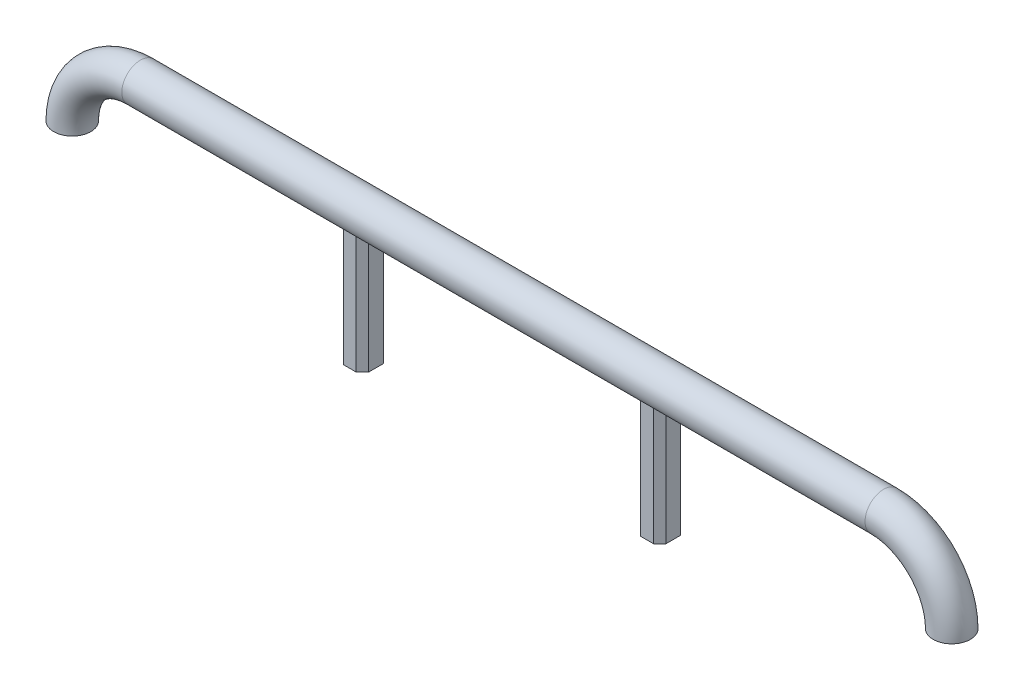
ISO-10303-21;
HEADER;
FILE_DESCRIPTION(('STEP AP214'),'2;1');
FILE_NAME('part.step','',(''),(''),'','','');
FILE_SCHEMA(('AUTOMOTIVE_DESIGN { 1 0 10303 214 1 1 1 1 }'));
ENDSEC;
DATA;
#1=APPLICATION_CONTEXT('core data for automotive mechanical design processes');
#2=APPLICATION_PROTOCOL_DEFINITION('international standard','automotive_design',2000,#1);
#3=PRODUCT_CONTEXT('',#1,'mechanical');
#4=PRODUCT('Part','Part','',(#3));
#5=PRODUCT_RELATED_PRODUCT_CATEGORY('part','',(#4));
#6=PRODUCT_DEFINITION_FORMATION('','',#4);
#7=PRODUCT_DEFINITION_CONTEXT('part definition',#1,'design');
#8=PRODUCT_DEFINITION('design','',#6,#7);
#9=PRODUCT_DEFINITION_SHAPE('','',#8);
#10=(LENGTH_UNIT() NAMED_UNIT(*) SI_UNIT(.MILLI.,.METRE.));
#11=(NAMED_UNIT(*) PLANE_ANGLE_UNIT() SI_UNIT($,.RADIAN.));
#12=(NAMED_UNIT(*) SI_UNIT($,.STERADIAN.) SOLID_ANGLE_UNIT());
#13=UNCERTAINTY_MEASURE_WITH_UNIT(LENGTH_MEASURE(1.E-05),#10,'distance_accuracy_value','');
#14=(GEOMETRIC_REPRESENTATION_CONTEXT(3) GLOBAL_UNCERTAINTY_ASSIGNED_CONTEXT((#13)) GLOBAL_UNIT_ASSIGNED_CONTEXT((#10,
#11,#12)) REPRESENTATION_CONTEXT('',''));
#15=CARTESIAN_POINT('',(0.,0.,0.));
#16=DIRECTION('',(0.,0.,1.));
#17=DIRECTION('',(1.,0.,0.));
#18=AXIS2_PLACEMENT_3D('',#15,#16,#17);
#19=CARTESIAN_POINT('',(381.,6.35,0.));
#20=DIRECTION('',(-1.,0.,0.));
#21=DIRECTION('',(0.,0.,1.));
#22=AXIS2_PLACEMENT_3D('',#19,#20,#21);
#23=CYLINDRICAL_SURFACE('',#22,19.05);
#24=CARTESIAN_POINT('',(139.409321276214,6.35,0.));
#25=DIRECTION('',(-1.,0.,0.));
#26=DIRECTION('',(0.,0.,1.));
#27=AXIS2_PLACEMENT_3D('',#24,#25,#26);
#28=CIRCLE('',#27,19.05);
#29=CARTESIAN_POINT('',(139.409321276214,-11.1254614235985,-7.58358411520046));
#30=VERTEX_POINT('',#29);
#31=CARTESIAN_POINT('',(139.409321276214,-11.1254614235984,7.58358411520061));
#32=VERTEX_POINT('',#31);
#33=EDGE_CURVE('E224',#30,#32,#28,.T.);
#34=ORIENTED_EDGE('',*,*,#33,.T.);
#35=CARTESIAN_POINT('',(131.825737161013,6.35,0.));
#36=DIRECTION('',(0.707106781186548,0.,-0.707106781186547));
#37=DIRECTION('',(-0.707106781186547,0.,-0.707106781186548));
#38=AXIS2_PLACEMENT_3D('',#35,#36,#37);
#39=ELLIPSE('',#38,26.9407683632075,19.05);
#40=CARTESIAN_POINT('',(145.759321276214,-6.64067872378632,13.9335841152004));
#41=VERTEX_POINT('',#40);
#42=EDGE_CURVE('E314',#32,#41,#39,.F.);
#43=ORIENTED_EDGE('',*,*,#42,.T.);
#44=DIRECTION('',(-1.,0.,0.));
#45=VECTOR('',#44,1.);
#46=CARTESIAN_POINT('',(381.,-6.64067872378632,13.9335841152004));
#47=LINE('',#46,#45);
#48=CARTESIAN_POINT('',(159.040678723786,-6.64067872378632,13.9335841152004));
#49=VERTEX_POINT('',#48);
#50=EDGE_CURVE('E228',#41,#49,#47,.F.);
#51=ORIENTED_EDGE('',*,*,#50,.T.);
#52=CARTESIAN_POINT('',(172.974262838987,6.35,0.));
#53=DIRECTION('',(-0.707106781186554,0.,-0.707106781186541));
#54=DIRECTION('',(-0.707106781186541,0.,0.707106781186554));
#55=AXIS2_PLACEMENT_3D('',#52,#53,#54);
#56=ELLIPSE('',#55,26.9407683632072,19.05);
#57=CARTESIAN_POINT('',(165.390678723786,-11.1254614235985,7.58358411520039));
#58=VERTEX_POINT('',#57);
#59=EDGE_CURVE('E317',#49,#58,#56,.F.);
#60=ORIENTED_EDGE('',*,*,#59,.T.);
#61=CARTESIAN_POINT('',(165.390678723786,6.35,0.));
#62=DIRECTION('',(1.,0.,0.));
#63=DIRECTION('',(0.,0.,-1.));
#64=AXIS2_PLACEMENT_3D('',#61,#62,#63);
#65=CIRCLE('',#64,19.05);
#66=CARTESIAN_POINT('',(165.390678723786,-11.1254614235985,-7.58358411520057));
#67=VERTEX_POINT('',#66);
#68=EDGE_CURVE('E232',#58,#67,#65,.T.);
#69=ORIENTED_EDGE('',*,*,#68,.T.);
#70=CARTESIAN_POINT('',(172.974262838987,6.35,0.));
#71=DIRECTION('',(-0.707106781186548,0.,0.707106781186548));
#72=DIRECTION('',(-0.707106781186547,0.,-0.707106781186548));
#73=AXIS2_PLACEMENT_3D('',#70,#71,#72);
#74=ELLIPSE('',#73,26.9407683632075,19.05);
#75=CARTESIAN_POINT('',(159.040678723786,-6.64067872378615,-13.9335841152006));
#76=VERTEX_POINT('',#75);
#77=EDGE_CURVE('E54',#67,#76,#74,.F.);
#78=ORIENTED_EDGE('',*,*,#77,.T.);
#79=DIRECTION('',(-1.,0.,0.));
#80=VECTOR('',#79,1.);
#81=CARTESIAN_POINT('',(381.,-6.64067872378615,-13.9335841152006));
#82=LINE('',#81,#80);
#83=CARTESIAN_POINT('',(145.759321276214,-6.64067872378615,-13.9335841152006));
#84=VERTEX_POINT('',#83);
#85=EDGE_CURVE('E221',#76,#84,#82,.T.);
#86=ORIENTED_EDGE('',*,*,#85,.T.);
#87=CARTESIAN_POINT('',(131.825737161013,6.35,0.));
#88=DIRECTION('',(0.707106781186547,0.,0.707106781186548));
#89=DIRECTION('',(-0.707106781186548,0.,0.707106781186547));
#90=AXIS2_PLACEMENT_3D('',#87,#88,#89);
#91=ELLIPSE('',#90,26.9407683632075,19.05);
#92=EDGE_CURVE('E11',#84,#30,#91,.F.);
#93=ORIENTED_EDGE('',*,*,#92,.T.);
#94=EDGE_LOOP('',(#34,#43,#51,#60,#69,#78,#86,#93));
#95=FACE_BOUND('',#94,.T.);
#96=DIRECTION('',(-1.,0.,0.));
#97=VECTOR('',#96,1.);
#98=CARTESIAN_POINT('',(381.,-6.64067872378616,-13.9335841152006));
#99=LINE('',#98,#97);
#100=CARTESIAN_POINT('',(-159.040678723786,-6.64067872378616,-13.9335841152006));
#101=VERTEX_POINT('',#100);
#102=CARTESIAN_POINT('',(-145.759321276214,-6.64067872378616,-13.9335841152006));
#103=VERTEX_POINT('',#102);
#104=EDGE_CURVE('E193',#101,#103,#99,.F.);
#105=ORIENTED_EDGE('',*,*,#104,.F.);
#106=CARTESIAN_POINT('',(-172.974262838986,6.35,0.));
#107=DIRECTION('',(0.707106781186554,0.,0.707106781186541));
#108=DIRECTION('',(-0.707106781186541,0.,0.707106781186554));
#109=AXIS2_PLACEMENT_3D('',#106,#107,#108);
#110=ELLIPSE('',#109,26.9407683632072,19.05);
#111=CARTESIAN_POINT('',(-165.390678723786,-11.1254614235985,-7.58358411520045));
#112=VERTEX_POINT('',#111);
#113=EDGE_CURVE('E308',#101,#112,#110,.F.);
#114=ORIENTED_EDGE('',*,*,#113,.T.);
#115=CARTESIAN_POINT('',(-165.390678723786,6.35,0.));
#116=DIRECTION('',(-1.,0.,0.));
#117=DIRECTION('',(0.,0.,1.));
#118=AXIS2_PLACEMENT_3D('',#115,#116,#117);
#119=CIRCLE('',#118,19.05);
#120=CARTESIAN_POINT('',(-165.390678723786,-11.1254614235985,7.58358411520053));
#121=VERTEX_POINT('',#120);
#122=EDGE_CURVE('E217',#121,#112,#119,.F.);
#123=ORIENTED_EDGE('',*,*,#122,.F.);
#124=CARTESIAN_POINT('',(-172.974262838987,6.35,0.));
#125=DIRECTION('',(0.707106781186548,0.,-0.707106781186548));
#126=DIRECTION('',(-0.707106781186548,0.,-0.707106781186548));
#127=AXIS2_PLACEMENT_3D('',#124,#125,#126);
#128=ELLIPSE('',#127,26.9407683632075,19.05);
#129=CARTESIAN_POINT('',(-159.040678723786,-6.64067872378628,13.9335841152005));
#130=VERTEX_POINT('',#129);
#131=EDGE_CURVE('E169',#121,#130,#128,.F.);
#132=ORIENTED_EDGE('',*,*,#131,.T.);
#133=DIRECTION('',(-1.,0.,0.));
#134=VECTOR('',#133,1.);
#135=CARTESIAN_POINT('',(381.,-6.64067872378628,13.9335841152005));
#136=LINE('',#135,#134);
#137=CARTESIAN_POINT('',(-145.759321276214,-6.64067872378628,13.9335841152005));
#138=VERTEX_POINT('',#137);
#139=EDGE_CURVE('E176',#138,#130,#136,.T.);
#140=ORIENTED_EDGE('',*,*,#139,.F.);
#141=CARTESIAN_POINT('',(-131.825737161013,6.35,0.));
#142=DIRECTION('',(-0.707106781186548,0.,-0.707106781186548));
#143=DIRECTION('',(-0.707106781186548,0.,0.707106781186548));
#144=AXIS2_PLACEMENT_3D('',#141,#142,#143);
#145=ELLIPSE('',#144,26.9407683632075,19.05);
#146=CARTESIAN_POINT('',(-139.409321276214,-11.1254614235985,7.58358411520042));
#147=VERTEX_POINT('',#146);
#148=EDGE_CURVE('E158',#138,#147,#145,.F.);
#149=ORIENTED_EDGE('',*,*,#148,.T.);
#150=CARTESIAN_POINT('',(-139.409321276214,6.35,0.));
#151=DIRECTION('',(1.,0.,0.));
#152=DIRECTION('',(0.,0.,-1.));
#153=AXIS2_PLACEMENT_3D('',#150,#151,#152);
#154=CIRCLE('',#153,19.05);
#155=CARTESIAN_POINT('',(-139.409321276214,-11.1254614235985,-7.58358411520045));
#156=VERTEX_POINT('',#155);
#157=EDGE_CURVE('E188',#156,#147,#154,.F.);
#158=ORIENTED_EDGE('',*,*,#157,.F.);
#159=CARTESIAN_POINT('',(-131.825737161013,6.35,0.));
#160=DIRECTION('',(-0.707106781186548,0.,0.707106781186548));
#161=DIRECTION('',(-0.707106781186548,0.,-0.707106781186548));
#162=AXIS2_PLACEMENT_3D('',#159,#160,#161);
#163=ELLIPSE('',#162,26.9407683632075,19.05);
#164=EDGE_CURVE('E311',#156,#103,#163,.F.);
#165=ORIENTED_EDGE('',*,*,#164,.T.);
#166=EDGE_LOOP('',(#105,#114,#123,#132,#140,#149,#158,#165));
#167=FACE_BOUND('',#166,.T.);
#168=CARTESIAN_POINT('',(381.,6.35,0.));
#169=DIRECTION('',(1.,0.,0.));
#170=DIRECTION('',(0.,0.,-1.));
#171=AXIS2_PLACEMENT_3D('',#168,#169,#170);
#172=CIRCLE('',#171,19.05);
#173=CARTESIAN_POINT('',(381.,25.4,0.));
#174=VERTEX_POINT('',#173);
#175=EDGE_CURVE('E189',#174,#174,#172,.T.);
#176=ORIENTED_EDGE('',*,*,#175,.F.);
#177=EDGE_LOOP('',(#176));
#178=FACE_BOUND('',#177,.T.);
#179=CARTESIAN_POINT('',(-381.,6.35,0.));
#180=DIRECTION('',(-1.,0.,0.));
#181=DIRECTION('',(0.,0.,1.));
#182=AXIS2_PLACEMENT_3D('',#179,#180,#181);
#183=CIRCLE('',#182,19.05);
#184=CARTESIAN_POINT('',(-381.,25.4,0.));
#185=VERTEX_POINT('',#184);
#186=EDGE_CURVE('E351',#185,#185,#183,.T.);
#187=ORIENTED_EDGE('',*,*,#186,.F.);
#188=EDGE_LOOP('',(#187));
#189=FACE_BOUND('',#188,.T.);
#190=ADVANCED_FACE('F44',(#95,#167,#178,#189),#23,.T.);
#191=CARTESIAN_POINT('',(-139.409321276214,-127.,-13.9335841152005));
#192=DIRECTION('',(0.,0.,-1.));
#193=DIRECTION('',(-1.,0.,0.));
#194=AXIS2_PLACEMENT_3D('',#191,#192,#193);
#195=PLANE('',#194);
#196=DIRECTION('',(-1.,0.,0.));
#197=VECTOR('',#196,1.);
#198=CARTESIAN_POINT('',(-139.409321276214,-127.,-13.9335841152005));
#199=LINE('',#198,#197);
#200=CARTESIAN_POINT('',(-145.759321276214,-127.,-13.9335841152005));
#201=VERTEX_POINT('',#200);
#202=CARTESIAN_POINT('',(-159.040678723786,-127.,-13.9335841152005));
#203=VERTEX_POINT('',#202);
#204=EDGE_CURVE('E203',#201,#203,#199,.T.);
#205=ORIENTED_EDGE('',*,*,#204,.T.);
#206=DIRECTION('',(0.,1.,0.));
#207=VECTOR('',#206,1.);
#208=CARTESIAN_POINT('',(-159.040678723786,-127.,-13.9335841152005));
#209=LINE('',#208,#207);
#210=EDGE_CURVE('E264',#203,#101,#209,.T.);
#211=ORIENTED_EDGE('',*,*,#210,.T.);
#212=ORIENTED_EDGE('',*,*,#104,.T.);
#213=DIRECTION('',(0.,-1.,0.));
#214=VECTOR('',#213,1.);
#215=CARTESIAN_POINT('',(-145.759321276214,-127.,-13.9335841152005));
#216=LINE('',#215,#214);
#217=EDGE_CURVE('E261',#103,#201,#216,.T.);
#218=ORIENTED_EDGE('',*,*,#217,.T.);
#219=EDGE_LOOP('',(#205,#211,#212,#218));
#220=FACE_BOUND('',#219,.T.);
#221=ADVANCED_FACE('F386',(#220),#195,.T.);
#222=CARTESIAN_POINT('',(-139.409321276214,-127.,13.9335841152005));
#223=DIRECTION('',(0.,0.,1.));
#224=DIRECTION('',(1.,0.,0.));
#225=AXIS2_PLACEMENT_3D('',#222,#223,#224);
#226=PLANE('',#225);
#227=DIRECTION('',(1.,0.,0.));
#228=VECTOR('',#227,1.);
#229=CARTESIAN_POINT('',(-139.409321276214,-127.,13.9335841152005));
#230=LINE('',#229,#228);
#231=CARTESIAN_POINT('',(-159.040678723786,-127.,13.9335841152005));
#232=VERTEX_POINT('',#231);
#233=CARTESIAN_POINT('',(-145.759321276214,-127.,13.9335841152005));
#234=VERTEX_POINT('',#233);
#235=EDGE_CURVE('E179',#232,#234,#230,.T.);
#236=ORIENTED_EDGE('',*,*,#235,.T.);
#237=DIRECTION('',(0.,1.,0.));
#238=VECTOR('',#237,1.);
#239=CARTESIAN_POINT('',(-145.759321276214,-127.,13.9335841152005));
#240=LINE('',#239,#238);
#241=EDGE_CURVE('E162',#234,#138,#240,.T.);
#242=ORIENTED_EDGE('',*,*,#241,.T.);
#243=ORIENTED_EDGE('',*,*,#139,.T.);
#244=DIRECTION('',(0.,-1.,0.));
#245=VECTOR('',#244,1.);
#246=CARTESIAN_POINT('',(-159.040678723786,-127.,13.9335841152005));
#247=LINE('',#246,#245);
#248=EDGE_CURVE('E182',#130,#232,#247,.T.);
#249=ORIENTED_EDGE('',*,*,#248,.T.);
#250=EDGE_LOOP('',(#236,#242,#243,#249));
#251=FACE_BOUND('',#250,.T.);
#252=ADVANCED_FACE('F175',(#251),#226,.T.);
#253=CARTESIAN_POINT('',(-139.409321276214,-127.,13.9335841152005));
#254=DIRECTION('',(1.,0.,0.));
#255=DIRECTION('',(0.,0.,-1.));
#256=AXIS2_PLACEMENT_3D('',#253,#254,#255);
#257=PLANE('',#256);
#258=ORIENTED_EDGE('',*,*,#157,.T.);
#259=DIRECTION('',(0.,-1.,0.));
#260=VECTOR('',#259,1.);
#261=CARTESIAN_POINT('',(-139.409321276214,-127.,7.58358411520042));
#262=LINE('',#261,#260);
#263=CARTESIAN_POINT('',(-139.409321276214,-127.,7.58358411520042));
#264=VERTEX_POINT('',#263);
#265=EDGE_CURVE('E163',#147,#264,#262,.T.);
#266=ORIENTED_EDGE('',*,*,#265,.T.);
#267=DIRECTION('',(0.,0.,-1.));
#268=VECTOR('',#267,1.);
#269=CARTESIAN_POINT('',(-139.409321276214,-127.,13.9335841152005));
#270=LINE('',#269,#268);
#271=CARTESIAN_POINT('',(-139.409321276214,-127.,-7.58358411520045));
#272=VERTEX_POINT('',#271);
#273=EDGE_CURVE('E213',#264,#272,#270,.T.);
#274=ORIENTED_EDGE('',*,*,#273,.T.);
#275=DIRECTION('',(0.,1.,0.));
#276=VECTOR('',#275,1.);
#277=CARTESIAN_POINT('',(-139.409321276214,-127.,-7.58358411520045));
#278=LINE('',#277,#276);
#279=EDGE_CURVE('E181',#272,#156,#278,.T.);
#280=ORIENTED_EDGE('',*,*,#279,.T.);
#281=EDGE_LOOP('',(#258,#266,#274,#280));
#282=FACE_BOUND('',#281,.T.);
#283=ADVANCED_FACE('F401',(#282),#257,.T.);
#284=CARTESIAN_POINT('',(-165.390678723786,-127.,-13.9335841152005));
#285=DIRECTION('',(-1.,0.,0.));
#286=DIRECTION('',(0.,0.,1.));
#287=AXIS2_PLACEMENT_3D('',#284,#285,#286);
#288=PLANE('',#287);
#289=DIRECTION('',(0.,0.,1.));
#290=VECTOR('',#289,1.);
#291=CARTESIAN_POINT('',(-165.390678723786,-127.,-13.9335841152005));
#292=LINE('',#291,#290);
#293=CARTESIAN_POINT('',(-165.390678723786,-127.,-7.58358411520045));
#294=VERTEX_POINT('',#293);
#295=CARTESIAN_POINT('',(-165.390678723786,-127.,7.58358411520053));
#296=VERTEX_POINT('',#295);
#297=EDGE_CURVE('E207',#294,#296,#292,.T.);
#298=ORIENTED_EDGE('',*,*,#297,.T.);
#299=DIRECTION('',(0.,1.,0.));
#300=VECTOR('',#299,1.);
#301=CARTESIAN_POINT('',(-165.390678723786,-127.,7.58358411520053));
#302=LINE('',#301,#300);
#303=EDGE_CURVE('E257',#296,#121,#302,.T.);
#304=ORIENTED_EDGE('',*,*,#303,.T.);
#305=ORIENTED_EDGE('',*,*,#122,.T.);
#306=DIRECTION('',(0.,-1.,0.));
#307=VECTOR('',#306,1.);
#308=CARTESIAN_POINT('',(-165.390678723786,-127.,-7.58358411520045));
#309=LINE('',#308,#307);
#310=EDGE_CURVE('E254',#112,#294,#309,.T.);
#311=ORIENTED_EDGE('',*,*,#310,.T.);
#312=EDGE_LOOP('',(#298,#304,#305,#311));
#313=FACE_BOUND('',#312,.T.);
#314=ADVANCED_FACE('F399',(#313),#288,.T.);
#315=CARTESIAN_POINT('',(0.,-127.,0.));
#316=DIRECTION('',(0.,1.,0.));
#317=DIRECTION('',(0.,0.,1.));
#318=AXIS2_PLACEMENT_3D('',#315,#316,#317);
#319=PLANE('',#318);
#320=ORIENTED_EDGE('',*,*,#273,.F.);
#321=DIRECTION('',(0.707106781186548,0.,-0.707106781186548));
#322=VECTOR('',#321,1.);
#323=CARTESIAN_POINT('',(-145.759321276214,-127.,13.9335841152005));
#324=LINE('',#323,#322);
#325=EDGE_CURVE('E251',#264,#234,#324,.F.);
#326=ORIENTED_EDGE('',*,*,#325,.T.);
#327=ORIENTED_EDGE('',*,*,#235,.F.);
#328=DIRECTION('',(0.707106781186548,0.,0.707106781186548));
#329=VECTOR('',#328,1.);
#330=CARTESIAN_POINT('',(-165.390678723786,-127.,7.58358411520053));
#331=LINE('',#330,#329);
#332=EDGE_CURVE('E248',#232,#296,#331,.F.);
#333=ORIENTED_EDGE('',*,*,#332,.T.);
#334=ORIENTED_EDGE('',*,*,#297,.F.);
#335=DIRECTION('',(-0.707106781186541,0.,0.707106781186554));
#336=VECTOR('',#335,1.);
#337=CARTESIAN_POINT('',(-159.040678723786,-127.,-13.9335841152005));
#338=LINE('',#337,#336);
#339=EDGE_CURVE('E245',#294,#203,#338,.F.);
#340=ORIENTED_EDGE('',*,*,#339,.T.);
#341=ORIENTED_EDGE('',*,*,#204,.F.);
#342=DIRECTION('',(-0.707106781186548,0.,-0.707106781186548));
#343=VECTOR('',#342,1.);
#344=CARTESIAN_POINT('',(-139.409321276214,-127.,-7.58358411520045));
#345=LINE('',#344,#343);
#346=EDGE_CURVE('E242',#201,#272,#345,.F.);
#347=ORIENTED_EDGE('',*,*,#346,.T.);
#348=EDGE_LOOP('',(#320,#326,#327,#333,#334,#340,#341,#347));
#349=FACE_BOUND('',#348,.T.);
#350=ADVANCED_FACE('F396',(#349),#319,.F.);
#351=CARTESIAN_POINT('',(165.390678723786,-127.,13.9335841152005));
#352=DIRECTION('',(0.,0.,1.));
#353=DIRECTION('',(1.,0.,0.));
#354=AXIS2_PLACEMENT_3D('',#351,#352,#353);
#355=PLANE('',#354);
#356=ORIENTED_EDGE('',*,*,#50,.F.);
#357=DIRECTION('',(0.,-1.,0.));
#358=VECTOR('',#357,1.);
#359=CARTESIAN_POINT('',(145.759321276214,-127.,13.9335841152005));
#360=LINE('',#359,#358);
#361=CARTESIAN_POINT('',(145.759321276214,-127.,13.9335841152005));
#362=VERTEX_POINT('',#361);
#363=EDGE_CURVE('E279',#41,#362,#360,.T.);
#364=ORIENTED_EDGE('',*,*,#363,.T.);
#365=DIRECTION('',(1.,0.,0.));
#366=VECTOR('',#365,1.);
#367=CARTESIAN_POINT('',(165.390678723786,-127.,13.9335841152005));
#368=LINE('',#367,#366);
#369=CARTESIAN_POINT('',(159.040678723786,-127.,13.9335841152005));
#370=VERTEX_POINT('',#369);
#371=EDGE_CURVE('E336',#362,#370,#368,.T.);
#372=ORIENTED_EDGE('',*,*,#371,.T.);
#373=DIRECTION('',(0.,1.,0.));
#374=VECTOR('',#373,1.);
#375=CARTESIAN_POINT('',(159.040678723786,-127.,13.9335841152005));
#376=LINE('',#375,#374);
#377=EDGE_CURVE('E275',#370,#49,#376,.T.);
#378=ORIENTED_EDGE('',*,*,#377,.T.);
#379=EDGE_LOOP('',(#356,#364,#372,#378));
#380=FACE_BOUND('',#379,.T.);
#381=ADVANCED_FACE('F339',(#380),#355,.T.);
#382=CARTESIAN_POINT('',(165.390678723786,-127.,-13.9335841152005));
#383=DIRECTION('',(0.,0.,-1.));
#384=DIRECTION('',(-1.,0.,0.));
#385=AXIS2_PLACEMENT_3D('',#382,#383,#384);
#386=PLANE('',#385);
#387=ORIENTED_EDGE('',*,*,#85,.F.);
#388=DIRECTION('',(0.,-1.,0.));
#389=VECTOR('',#388,1.);
#390=CARTESIAN_POINT('',(159.040678723786,-127.,-13.9335841152005));
#391=LINE('',#390,#389);
#392=CARTESIAN_POINT('',(159.040678723786,-127.,-13.9335841152005));
#393=VERTEX_POINT('',#392);
#394=EDGE_CURVE('E170',#76,#393,#391,.T.);
#395=ORIENTED_EDGE('',*,*,#394,.T.);
#396=DIRECTION('',(-1.,0.,0.));
#397=VECTOR('',#396,1.);
#398=CARTESIAN_POINT('',(165.390678723786,-127.,-13.9335841152005));
#399=LINE('',#398,#397);
#400=CARTESIAN_POINT('',(145.759321276214,-127.,-13.9335841152005));
#401=VERTEX_POINT('',#400);
#402=EDGE_CURVE('E348',#393,#401,#399,.T.);
#403=ORIENTED_EDGE('',*,*,#402,.T.);
#404=DIRECTION('',(0.,1.,0.));
#405=VECTOR('',#404,1.);
#406=CARTESIAN_POINT('',(145.759321276214,-127.,-13.9335841152005));
#407=LINE('',#406,#405);
#408=EDGE_CURVE('E301',#401,#84,#407,.T.);
#409=ORIENTED_EDGE('',*,*,#408,.T.);
#410=EDGE_LOOP('',(#387,#395,#403,#409));
#411=FACE_BOUND('',#410,.T.);
#412=ADVANCED_FACE('F364',(#411),#386,.T.);
#413=CARTESIAN_POINT('',(165.390678723786,-127.,13.9335841152005));
#414=DIRECTION('',(1.,0.,0.));
#415=DIRECTION('',(0.,0.,-1.));
#416=AXIS2_PLACEMENT_3D('',#413,#414,#415);
#417=PLANE('',#416);
#418=ORIENTED_EDGE('',*,*,#68,.F.);
#419=DIRECTION('',(0.,-1.,0.));
#420=VECTOR('',#419,1.);
#421=CARTESIAN_POINT('',(165.390678723786,-127.,7.58358411520039));
#422=LINE('',#421,#420);
#423=CARTESIAN_POINT('',(165.390678723786,-127.,7.58358411520039));
#424=VERTEX_POINT('',#423);
#425=EDGE_CURVE('E298',#58,#424,#422,.T.);
#426=ORIENTED_EDGE('',*,*,#425,.T.);
#427=DIRECTION('',(0.,0.,-1.));
#428=VECTOR('',#427,1.);
#429=CARTESIAN_POINT('',(165.390678723786,-127.,13.9335841152005));
#430=LINE('',#429,#428);
#431=CARTESIAN_POINT('',(165.390678723786,-127.,-7.58358411520057));
#432=VERTEX_POINT('',#431);
#433=EDGE_CURVE('E196',#424,#432,#430,.T.);
#434=ORIENTED_EDGE('',*,*,#433,.T.);
#435=DIRECTION('',(0.,1.,0.));
#436=VECTOR('',#435,1.);
#437=CARTESIAN_POINT('',(165.390678723786,-127.,-7.58358411520057));
#438=LINE('',#437,#436);
#439=EDGE_CURVE('E294',#432,#67,#438,.T.);
#440=ORIENTED_EDGE('',*,*,#439,.T.);
#441=EDGE_LOOP('',(#418,#426,#434,#440));
#442=FACE_BOUND('',#441,.T.);
#443=ADVANCED_FACE('F326',(#442),#417,.T.);
#444=CARTESIAN_POINT('',(139.409321276214,-127.,-13.9335841152005));
#445=DIRECTION('',(-1.,0.,0.));
#446=DIRECTION('',(0.,0.,1.));
#447=AXIS2_PLACEMENT_3D('',#444,#445,#446);
#448=PLANE('',#447);
#449=DIRECTION('',(0.,0.,1.));
#450=VECTOR('',#449,1.);
#451=CARTESIAN_POINT('',(139.409321276214,-127.,-13.9335841152005));
#452=LINE('',#451,#450);
#453=CARTESIAN_POINT('',(139.409321276214,-127.,-7.58358411520046));
#454=VERTEX_POINT('',#453);
#455=CARTESIAN_POINT('',(139.409321276214,-127.,7.58358411520061));
#456=VERTEX_POINT('',#455);
#457=EDGE_CURVE('E342',#454,#456,#452,.T.);
#458=ORIENTED_EDGE('',*,*,#457,.T.);
#459=DIRECTION('',(0.,1.,0.));
#460=VECTOR('',#459,1.);
#461=CARTESIAN_POINT('',(139.409321276214,-127.,7.58358411520061));
#462=LINE('',#461,#460);
#463=EDGE_CURVE('E271',#456,#32,#462,.T.);
#464=ORIENTED_EDGE('',*,*,#463,.T.);
#465=ORIENTED_EDGE('',*,*,#33,.F.);
#466=DIRECTION('',(0.,-1.,0.));
#467=VECTOR('',#466,1.);
#468=CARTESIAN_POINT('',(139.409321276214,-127.,-7.58358411520046));
#469=LINE('',#468,#467);
#470=EDGE_CURVE('E268',#30,#454,#469,.T.);
#471=ORIENTED_EDGE('',*,*,#470,.T.);
#472=EDGE_LOOP('',(#458,#464,#465,#471));
#473=FACE_BOUND('',#472,.T.);
#474=ADVANCED_FACE('F369',(#473),#448,.T.);
#475=CARTESIAN_POINT('',(0.,-127.,0.));
#476=DIRECTION('',(0.,1.,0.));
#477=DIRECTION('',(0.,0.,1.));
#478=AXIS2_PLACEMENT_3D('',#475,#476,#477);
#479=PLANE('',#478);
#480=ORIENTED_EDGE('',*,*,#371,.F.);
#481=DIRECTION('',(0.707106781186547,0.,0.707106781186548));
#482=VECTOR('',#481,1.);
#483=CARTESIAN_POINT('',(139.409321276214,-127.,7.5835841152006));
#484=LINE('',#483,#482);
#485=EDGE_CURVE('E291',#362,#456,#484,.F.);
#486=ORIENTED_EDGE('',*,*,#485,.T.);
#487=ORIENTED_EDGE('',*,*,#457,.F.);
#488=DIRECTION('',(-0.707106781186548,0.,0.707106781186547));
#489=VECTOR('',#488,1.);
#490=CARTESIAN_POINT('',(145.759321276214,-127.,-13.9335841152005));
#491=LINE('',#490,#489);
#492=EDGE_CURVE('E282',#454,#401,#491,.F.);
#493=ORIENTED_EDGE('',*,*,#492,.T.);
#494=ORIENTED_EDGE('',*,*,#402,.F.);
#495=DIRECTION('',(-0.707106781186547,0.,-0.707106781186548));
#496=VECTOR('',#495,1.);
#497=CARTESIAN_POINT('',(165.390678723786,-127.,-7.58358411520058));
#498=LINE('',#497,#496);
#499=EDGE_CURVE('E285',#393,#432,#498,.F.);
#500=ORIENTED_EDGE('',*,*,#499,.T.);
#501=ORIENTED_EDGE('',*,*,#433,.F.);
#502=DIRECTION('',(0.707106781186541,0.,-0.707106781186554));
#503=VECTOR('',#502,1.);
#504=CARTESIAN_POINT('',(159.040678723786,-127.,13.9335841152005));
#505=LINE('',#504,#503);
#506=EDGE_CURVE('E288',#424,#370,#505,.F.);
#507=ORIENTED_EDGE('',*,*,#506,.T.);
#508=EDGE_LOOP('',(#480,#486,#487,#493,#494,#500,#501,#507));
#509=FACE_BOUND('',#508,.T.);
#510=ADVANCED_FACE('F335',(#509),#479,.F.);
#511=CARTESIAN_POINT('',(-450.85,-63.4999999999999,0.));
#512=DIRECTION('',(0.,-1.,0.));
#513=DIRECTION('',(0.,0.,1.));
#514=AXIS2_PLACEMENT_3D('',#511,#512,#513);
#515=PLANE('',#514);
#516=CARTESIAN_POINT('',(-450.85,-63.4999999999999,0.));
#517=DIRECTION('',(0.,-1.,0.));
#518=DIRECTION('',(0.,0.,1.));
#519=AXIS2_PLACEMENT_3D('',#516,#517,#518);
#520=CIRCLE('',#519,19.05);
#521=CARTESIAN_POINT('',(-469.9,-63.4999999999999,0.));
#522=VERTEX_POINT('',#521);
#523=EDGE_CURVE('E343',#522,#522,#520,.T.);
#524=ORIENTED_EDGE('',*,*,#523,.T.);
#525=EDGE_LOOP('',(#524));
#526=FACE_BOUND('',#525,.T.);
#527=ADVANCED_FACE('F505',(#526),#515,.T.);
#528=CARTESIAN_POINT('',(-381.,-63.5,0.));
#529=DIRECTION('',(0.,0.,1.));
#530=DIRECTION('',(1.,0.,0.));
#531=AXIS2_PLACEMENT_3D('',#528,#529,#530);
#532=TOROIDAL_SURFACE('',#531,69.85,19.05);
#533=CARTESIAN_POINT('',(-381.,-63.5,0.));
#534=DIRECTION('',(0.,0.,1.));
#535=DIRECTION('',(1.,0.,0.));
#536=AXIS2_PLACEMENT_3D('',#533,#534,#535);
#537=CIRCLE('',#536,88.9);
#538=EDGE_CURVE('',#185,#522,#537,.T.);
#539=ORIENTED_EDGE('',*,*,#186,.T.);
#540=ORIENTED_EDGE('',*,*,#523,.F.);
#541=ORIENTED_EDGE('',*,*,#538,.T.);
#542=ORIENTED_EDGE('',*,*,#538,.F.);
#543=EDGE_LOOP('',(#539,#541,#540,#542));
#544=FACE_BOUND('',#543,.T.);
#545=ADVANCED_FACE('F506',(#544),#532,.T.);
#546=CARTESIAN_POINT('',(450.85,-63.5,0.));
#547=DIRECTION('',(0.,-1.,0.));
#548=DIRECTION('',(0.,0.,-1.));
#549=AXIS2_PLACEMENT_3D('',#546,#547,#548);
#550=PLANE('',#549);
#551=CARTESIAN_POINT('',(450.85,-63.5,0.));
#552=DIRECTION('',(0.,-1.,0.));
#553=DIRECTION('',(0.,0.,-1.));
#554=AXIS2_PLACEMENT_3D('',#551,#552,#553);
#555=CIRCLE('',#554,19.05);
#556=CARTESIAN_POINT('',(469.9,-63.5,0.));
#557=VERTEX_POINT('',#556);
#558=EDGE_CURVE('E637',#557,#557,#555,.T.);
#559=ORIENTED_EDGE('',*,*,#558,.T.);
#560=EDGE_LOOP('',(#559));
#561=FACE_BOUND('',#560,.T.);
#562=ADVANCED_FACE('F418',(#561),#550,.T.);
#563=CARTESIAN_POINT('',(381.,-63.5,0.));
#564=DIRECTION('',(0.,0.,-1.));
#565=DIRECTION('',(-1.,0.,0.));
#566=AXIS2_PLACEMENT_3D('',#563,#564,#565);
#567=TOROIDAL_SURFACE('',#566,69.85,19.05);
#568=CARTESIAN_POINT('',(381.,-63.5,0.));
#569=DIRECTION('',(0.,0.,-1.));
#570=DIRECTION('',(-1.,0.,0.));
#571=AXIS2_PLACEMENT_3D('',#568,#569,#570);
#572=CIRCLE('',#571,88.9);
#573=EDGE_CURVE('',#174,#557,#572,.T.);
#574=ORIENTED_EDGE('',*,*,#175,.T.);
#575=ORIENTED_EDGE('',*,*,#558,.F.);
#576=ORIENTED_EDGE('',*,*,#573,.T.);
#577=ORIENTED_EDGE('',*,*,#573,.F.);
#578=EDGE_LOOP('',(#574,#576,#575,#577));
#579=FACE_BOUND('',#578,.T.);
#580=ADVANCED_FACE('F417',(#579),#567,.T.);
#581=CARTESIAN_POINT('',(-145.759321276214,-127.,13.9335841152005));
#582=DIRECTION('',(-0.707106781186548,0.,-0.707106781186548));
#583=DIRECTION('',(0.,1.,0.));
#584=AXIS2_PLACEMENT_3D('',#581,#582,#583);
#585=PLANE('',#584);
#586=ORIENTED_EDGE('',*,*,#325,.F.);
#587=ORIENTED_EDGE('',*,*,#265,.F.);
#588=ORIENTED_EDGE('',*,*,#148,.F.);
#589=ORIENTED_EDGE('',*,*,#241,.F.);
#590=EDGE_LOOP('',(#586,#587,#588,#589));
#591=FACE_BOUND('',#590,.T.);
#592=ADVANCED_FACE('F161',(#591),#585,.F.);
#593=CARTESIAN_POINT('',(-165.390678723786,-127.,7.58358411520053));
#594=DIRECTION('',(0.707106781186548,0.,-0.707106781186548));
#595=DIRECTION('',(0.,1.,0.));
#596=AXIS2_PLACEMENT_3D('',#593,#594,#595);
#597=PLANE('',#596);
#598=ORIENTED_EDGE('',*,*,#332,.F.);
#599=ORIENTED_EDGE('',*,*,#248,.F.);
#600=ORIENTED_EDGE('',*,*,#131,.F.);
#601=ORIENTED_EDGE('',*,*,#303,.F.);
#602=EDGE_LOOP('',(#598,#599,#600,#601));
#603=FACE_BOUND('',#602,.T.);
#604=ADVANCED_FACE('F416',(#603),#597,.F.);
#605=CARTESIAN_POINT('',(-159.040678723786,-127.,-13.9335841152005));
#606=DIRECTION('',(0.707106781186554,0.,0.707106781186541));
#607=DIRECTION('',(0.,1.,0.));
#608=AXIS2_PLACEMENT_3D('',#605,#606,#607);
#609=PLANE('',#608);
#610=ORIENTED_EDGE('',*,*,#339,.F.);
#611=ORIENTED_EDGE('',*,*,#310,.F.);
#612=ORIENTED_EDGE('',*,*,#113,.F.);
#613=ORIENTED_EDGE('',*,*,#210,.F.);
#614=EDGE_LOOP('',(#610,#611,#612,#613));
#615=FACE_BOUND('',#614,.T.);
#616=ADVANCED_FACE('F381',(#615),#609,.F.);
#617=CARTESIAN_POINT('',(-139.409321276214,-127.,-7.58358411520045));
#618=DIRECTION('',(-0.707106781186548,0.,0.707106781186548));
#619=DIRECTION('',(0.,1.,0.));
#620=AXIS2_PLACEMENT_3D('',#617,#618,#619);
#621=PLANE('',#620);
#622=ORIENTED_EDGE('',*,*,#346,.F.);
#623=ORIENTED_EDGE('',*,*,#217,.F.);
#624=ORIENTED_EDGE('',*,*,#164,.F.);
#625=ORIENTED_EDGE('',*,*,#279,.F.);
#626=EDGE_LOOP('',(#622,#623,#624,#625));
#627=FACE_BOUND('',#626,.T.);
#628=ADVANCED_FACE('F374',(#627),#621,.F.);
#629=CARTESIAN_POINT('',(139.409321276214,-127.,7.5835841152006));
#630=DIRECTION('',(0.707106781186548,0.,-0.707106781186547));
#631=DIRECTION('',(0.,1.,0.));
#632=AXIS2_PLACEMENT_3D('',#629,#630,#631);
#633=PLANE('',#632);
#634=ORIENTED_EDGE('',*,*,#485,.F.);
#635=ORIENTED_EDGE('',*,*,#363,.F.);
#636=ORIENTED_EDGE('',*,*,#42,.F.);
#637=ORIENTED_EDGE('',*,*,#463,.F.);
#638=EDGE_LOOP('',(#634,#635,#636,#637));
#639=FACE_BOUND('',#638,.T.);
#640=ADVANCED_FACE('F372',(#639),#633,.F.);
#641=CARTESIAN_POINT('',(159.040678723786,-127.,13.9335841152005));
#642=DIRECTION('',(-0.707106781186554,0.,-0.707106781186541));
#643=DIRECTION('',(0.,1.,0.));
#644=AXIS2_PLACEMENT_3D('',#641,#642,#643);
#645=PLANE('',#644);
#646=ORIENTED_EDGE('',*,*,#506,.F.);
#647=ORIENTED_EDGE('',*,*,#425,.F.);
#648=ORIENTED_EDGE('',*,*,#59,.F.);
#649=ORIENTED_EDGE('',*,*,#377,.F.);
#650=EDGE_LOOP('',(#646,#647,#648,#649));
#651=FACE_BOUND('',#650,.T.);
#652=ADVANCED_FACE('F331',(#651),#645,.F.);
#653=CARTESIAN_POINT('',(165.390678723786,-127.,-7.58358411520058));
#654=DIRECTION('',(-0.707106781186548,0.,0.707106781186548));
#655=DIRECTION('',(0.,1.,0.));
#656=AXIS2_PLACEMENT_3D('',#653,#654,#655);
#657=PLANE('',#656);
#658=ORIENTED_EDGE('',*,*,#499,.F.);
#659=ORIENTED_EDGE('',*,*,#394,.F.);
#660=ORIENTED_EDGE('',*,*,#77,.F.);
#661=ORIENTED_EDGE('',*,*,#439,.F.);
#662=EDGE_LOOP('',(#658,#659,#660,#661));
#663=FACE_BOUND('',#662,.T.);
#664=ADVANCED_FACE('F360',(#663),#657,.F.);
#665=CARTESIAN_POINT('',(145.759321276214,-127.,-13.9335841152005));
#666=DIRECTION('',(0.707106781186547,0.,0.707106781186548));
#667=DIRECTION('',(0.,1.,0.));
#668=AXIS2_PLACEMENT_3D('',#665,#666,#667);
#669=PLANE('',#668);
#670=ORIENTED_EDGE('',*,*,#492,.F.);
#671=ORIENTED_EDGE('',*,*,#470,.F.);
#672=ORIENTED_EDGE('',*,*,#92,.F.);
#673=ORIENTED_EDGE('',*,*,#408,.F.);
#674=EDGE_LOOP('',(#670,#671,#672,#673));
#675=FACE_BOUND('',#674,.T.);
#676=ADVANCED_FACE('F47',(#675),#669,.F.);
#677=CLOSED_SHELL('',(#190,#221,#252,#283,#314,#350,#381,#412,#443,#474,#510,#527,#545,#562,
#580,#592,#604,#616,#628,#640,#652,#664,#676));
#678=MANIFOLD_SOLID_BREP('B2',#677);
#679=ADVANCED_BREP_SHAPE_REPRESENTATION('',(#18,#678),#14);
#680=SHAPE_DEFINITION_REPRESENTATION(#9,#679);
ENDSEC;
END-ISO-10303-21;
